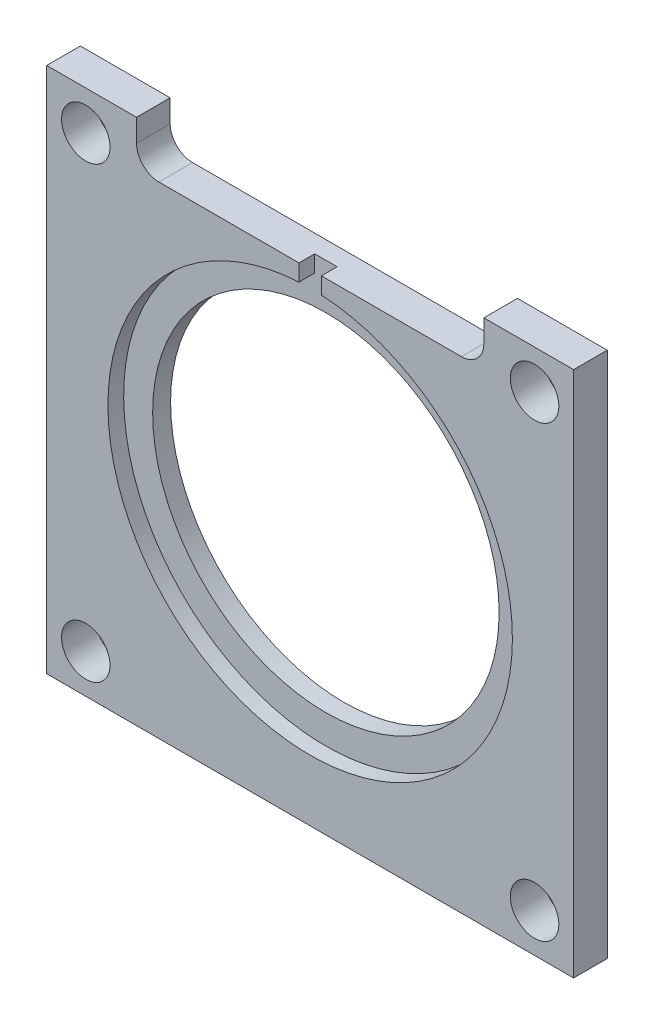
ISO-10303-21;
HEADER;
FILE_DESCRIPTION(('STEP AP214'),'2;1');
FILE_NAME('part.step','',(''),(''),'','','');
FILE_SCHEMA(('AUTOMOTIVE_DESIGN { 1 0 10303 214 1 1 1 1 }'));
ENDSEC;
DATA;
#1=APPLICATION_CONTEXT('core data for automotive mechanical design processes');
#2=APPLICATION_PROTOCOL_DEFINITION('international standard','automotive_design',2000,#1);
#3=PRODUCT_CONTEXT('',#1,'mechanical');
#4=PRODUCT('Part','Part','',(#3));
#5=PRODUCT_RELATED_PRODUCT_CATEGORY('part','',(#4));
#6=PRODUCT_DEFINITION_FORMATION('','',#4);
#7=PRODUCT_DEFINITION_CONTEXT('part definition',#1,'design');
#8=PRODUCT_DEFINITION('design','',#6,#7);
#9=PRODUCT_DEFINITION_SHAPE('','',#8);
#10=(LENGTH_UNIT() NAMED_UNIT(*) SI_UNIT(.MILLI.,.METRE.));
#11=(NAMED_UNIT(*) PLANE_ANGLE_UNIT() SI_UNIT($,.RADIAN.));
#12=(NAMED_UNIT(*) SI_UNIT($,.STERADIAN.) SOLID_ANGLE_UNIT());
#13=UNCERTAINTY_MEASURE_WITH_UNIT(LENGTH_MEASURE(1.E-05),#10,'distance_accuracy_value','');
#14=(GEOMETRIC_REPRESENTATION_CONTEXT(3) GLOBAL_UNCERTAINTY_ASSIGNED_CONTEXT((#13)) GLOBAL_UNIT_ASSIGNED_CONTEXT((#10,
#11,#12)) REPRESENTATION_CONTEXT('',''));
#15=CARTESIAN_POINT('',(0.,0.,0.));
#16=DIRECTION('',(0.,0.,1.));
#17=DIRECTION('',(1.,0.,0.));
#18=AXIS2_PLACEMENT_3D('',#15,#16,#17);
#19=CARTESIAN_POINT('',(0.,0.,-1.5875));
#20=DIRECTION('',(0.,0.,1.));
#21=DIRECTION('',(1.,0.,0.));
#22=AXIS2_PLACEMENT_3D('',#19,#20,#21);
#23=CYLINDRICAL_SURFACE('',#22,24.511);
#24=CARTESIAN_POINT('',(0.,0.,-1.5875));
#25=DIRECTION('',(0.,0.,1.));
#26=DIRECTION('',(1.,0.,0.));
#27=AXIS2_PLACEMENT_3D('',#24,#25,#26);
#28=CIRCLE('',#27,24.511);
#29=CARTESIAN_POINT('',(24.511,0.,-1.5875));
#30=VERTEX_POINT('',#29);
#31=EDGE_CURVE('E227',#30,#30,#28,.T.);
#32=ORIENTED_EDGE('',*,*,#31,.F.);
#33=EDGE_LOOP('',(#32));
#34=FACE_BOUND('',#33,.T.);
#35=CARTESIAN_POINT('',(0.,0.,0.9525));
#36=DIRECTION('',(0.,0.,1.));
#37=DIRECTION('',(1.,0.,0.));
#38=AXIS2_PLACEMENT_3D('',#35,#36,#37);
#39=CIRCLE('',#38,24.511);
#40=CARTESIAN_POINT('',(24.511,0.,0.9525));
#41=VERTEX_POINT('',#40);
#42=EDGE_CURVE('E158',#41,#41,#39,.F.);
#43=ORIENTED_EDGE('',*,*,#42,.F.);
#44=EDGE_LOOP('',(#43));
#45=FACE_BOUND('',#44,.T.);
#46=ADVANCED_FACE('F41',(#34,#45),#23,.F.);
#47=CARTESIAN_POINT('',(-37.2745,37.2745,-1.5875));
#48=DIRECTION('',(0.,1.,0.));
#49=DIRECTION('',(-1.,0.,0.));
#50=AXIS2_PLACEMENT_3D('',#47,#48,#49);
#51=PLANE('',#50);
#52=DIRECTION('',(0.,0.,1.));
#53=VECTOR('',#52,1.);
#54=CARTESIAN_POINT('',(-24.5745,37.2745,-1.5875));
#55=LINE('',#54,#53);
#56=CARTESIAN_POINT('',(-24.5745,37.2745,-1.5875));
#57=VERTEX_POINT('',#56);
#58=CARTESIAN_POINT('',(-24.5745,37.2745,3.175));
#59=VERTEX_POINT('',#58);
#60=EDGE_CURVE('E255',#57,#59,#55,.T.);
#61=ORIENTED_EDGE('',*,*,#60,.F.);
#62=DIRECTION('',(-1.,0.,0.));
#63=VECTOR('',#62,1.);
#64=CARTESIAN_POINT('',(-37.2745,37.2745,-1.5875));
#65=LINE('',#64,#63);
#66=CARTESIAN_POINT('',(-37.2745,37.2745,-1.5875));
#67=VERTEX_POINT('',#66);
#68=EDGE_CURVE('E239',#57,#67,#65,.T.);
#69=ORIENTED_EDGE('',*,*,#68,.T.);
#70=DIRECTION('',(0.,0.,1.));
#71=VECTOR('',#70,1.);
#72=CARTESIAN_POINT('',(-37.2745,37.2745,-1.5875));
#73=LINE('',#72,#71);
#74=CARTESIAN_POINT('',(-37.2745,37.2745,3.175));
#75=VERTEX_POINT('',#74);
#76=EDGE_CURVE('E244',#67,#75,#73,.T.);
#77=ORIENTED_EDGE('',*,*,#76,.T.);
#78=DIRECTION('',(-1.,0.,0.));
#79=VECTOR('',#78,1.);
#80=CARTESIAN_POINT('',(-37.2745,37.2745,3.175));
#81=LINE('',#80,#79);
#82=EDGE_CURVE('E223',#59,#75,#81,.T.);
#83=ORIENTED_EDGE('',*,*,#82,.F.);
#84=EDGE_LOOP('',(#61,#69,#77,#83));
#85=FACE_BOUND('',#84,.T.);
#86=ADVANCED_FACE('F313',(#85),#51,.T.);
#87=CARTESIAN_POINT('',(0.,0.,-1.5875));
#88=DIRECTION('',(0.,0.,1.));
#89=DIRECTION('',(1.,0.,0.));
#90=AXIS2_PLACEMENT_3D('',#87,#88,#89);
#91=PLANE('',#90);
#92=ORIENTED_EDGE('',*,*,#68,.F.);
#93=DIRECTION('',(0.,-1.,0.));
#94=VECTOR('',#93,1.);
#95=CARTESIAN_POINT('',(-24.5745,39.2150302847828,-1.5875));
#96=LINE('',#95,#94);
#97=CARTESIAN_POINT('',(-24.5745,34.0995,-1.5875));
#98=VERTEX_POINT('',#97);
#99=EDGE_CURVE('E180',#57,#98,#96,.T.);
#100=ORIENTED_EDGE('',*,*,#99,.T.);
#101=CARTESIAN_POINT('',(-21.3995,34.0995,-1.5875));
#102=DIRECTION('',(0.,0.,1.));
#103=DIRECTION('',(1.,0.,0.));
#104=AXIS2_PLACEMENT_3D('',#101,#102,#103);
#105=CIRCLE('',#104,3.175);
#106=CARTESIAN_POINT('',(-21.3995,30.9245,-1.5875));
#107=VERTEX_POINT('',#106);
#108=EDGE_CURVE('E274',#98,#107,#105,.T.);
#109=ORIENTED_EDGE('',*,*,#108,.T.);
#110=DIRECTION('',(1.,0.,0.));
#111=VECTOR('',#110,1.);
#112=CARTESIAN_POINT('',(-24.5745,30.9245,-1.5875));
#113=LINE('',#112,#111);
#114=CARTESIAN_POINT('',(21.3995,30.9245,-1.5875));
#115=VERTEX_POINT('',#114);
#116=EDGE_CURVE('E183',#107,#115,#113,.T.);
#117=ORIENTED_EDGE('',*,*,#116,.T.);
#118=CARTESIAN_POINT('',(21.3995,34.0995,-1.5875));
#119=DIRECTION('',(0.,0.,1.));
#120=DIRECTION('',(1.,0.,0.));
#121=AXIS2_PLACEMENT_3D('',#118,#119,#120);
#122=CIRCLE('',#121,3.175);
#123=CARTESIAN_POINT('',(24.5745,34.0995,-1.5875));
#124=VERTEX_POINT('',#123);
#125=EDGE_CURVE('E270',#115,#124,#122,.T.);
#126=ORIENTED_EDGE('',*,*,#125,.T.);
#127=DIRECTION('',(0.,1.,0.));
#128=VECTOR('',#127,1.);
#129=CARTESIAN_POINT('',(24.5745,39.2150302847828,-1.5875));
#130=LINE('',#129,#128);
#131=CARTESIAN_POINT('',(24.5745,37.2745,-1.5875));
#132=VERTEX_POINT('',#131);
#133=EDGE_CURVE('E186',#124,#132,#130,.T.);
#134=ORIENTED_EDGE('',*,*,#133,.T.);
#135=CARTESIAN_POINT('',(37.2745,37.2745,-1.5875));
#136=VERTEX_POINT('',#135);
#137=EDGE_CURVE('E240',#136,#132,#65,.T.);
#138=ORIENTED_EDGE('',*,*,#137,.F.);
#139=DIRECTION('',(0.,1.,0.));
#140=VECTOR('',#139,1.);
#141=CARTESIAN_POINT('',(37.2745,37.2745,-1.5875));
#142=LINE('',#141,#140);
#143=CARTESIAN_POINT('',(37.2745,-37.2745,-1.5875));
#144=VERTEX_POINT('',#143);
#145=EDGE_CURVE('E236',#144,#136,#142,.T.);
#146=ORIENTED_EDGE('',*,*,#145,.F.);
#147=DIRECTION('',(1.,0.,0.));
#148=VECTOR('',#147,1.);
#149=CARTESIAN_POINT('',(-37.2745,-37.2745,-1.5875));
#150=LINE('',#149,#148);
#151=CARTESIAN_POINT('',(-37.2745,-37.2745,-1.5875));
#152=VERTEX_POINT('',#151);
#153=EDGE_CURVE('E233',#152,#144,#150,.T.);
#154=ORIENTED_EDGE('',*,*,#153,.F.);
#155=DIRECTION('',(0.,-1.,0.));
#156=VECTOR('',#155,1.);
#157=CARTESIAN_POINT('',(-37.2745,37.2745,-1.5875));
#158=LINE('',#157,#156);
#159=EDGE_CURVE('E230',#67,#152,#158,.T.);
#160=ORIENTED_EDGE('',*,*,#159,.F.);
#161=EDGE_LOOP('',(#92,#100,#109,#117,#126,#134,#138,#146,#154,#160));
#162=FACE_BOUND('',#161,.T.);
#163=CARTESIAN_POINT('',(31.75,31.7499999999996,-1.5875));
#164=DIRECTION('',(0.,0.,-1.));
#165=DIRECTION('',(-1.,0.,0.));
#166=AXIS2_PLACEMENT_3D('',#163,#164,#165);
#167=CIRCLE('',#166,3.429);
#168=CARTESIAN_POINT('',(28.321,31.7499999999996,-1.5875));
#169=VERTEX_POINT('',#168);
#170=EDGE_CURVE('E203',#169,#169,#167,.T.);
#171=ORIENTED_EDGE('',*,*,#170,.F.);
#172=EDGE_LOOP('',(#171));
#173=FACE_BOUND('',#172,.T.);
#174=CARTESIAN_POINT('',(-31.75,31.7499999999996,-1.5875));
#175=DIRECTION('',(0.,0.,1.));
#176=DIRECTION('',(1.,0.,0.));
#177=AXIS2_PLACEMENT_3D('',#174,#175,#176);
#178=CIRCLE('',#177,3.429);
#179=CARTESIAN_POINT('',(-28.321,31.7499999999996,-1.5875));
#180=VERTEX_POINT('',#179);
#181=EDGE_CURVE('E209',#180,#180,#178,.T.);
#182=ORIENTED_EDGE('',*,*,#181,.T.);
#183=EDGE_LOOP('',(#182));
#184=FACE_BOUND('',#183,.T.);
#185=ORIENTED_EDGE('',*,*,#31,.T.);
#186=EDGE_LOOP('',(#185));
#187=FACE_BOUND('',#186,.T.);
#188=CARTESIAN_POINT('',(31.75,-31.7499999999996,-1.5875));
#189=DIRECTION('',(0.,0.,1.));
#190=DIRECTION('',(-1.,0.,0.));
#191=AXIS2_PLACEMENT_3D('',#188,#189,#190);
#192=CIRCLE('',#191,3.429);
#193=CARTESIAN_POINT('',(28.321,-31.7499999999996,-1.5875));
#194=VERTEX_POINT('',#193);
#195=EDGE_CURVE('E197',#194,#194,#192,.T.);
#196=ORIENTED_EDGE('',*,*,#195,.T.);
#197=EDGE_LOOP('',(#196));
#198=FACE_BOUND('',#197,.T.);
#199=CARTESIAN_POINT('',(-31.75,-31.7499999999996,-1.5875));
#200=DIRECTION('',(0.,0.,-1.));
#201=DIRECTION('',(1.,0.,0.));
#202=AXIS2_PLACEMENT_3D('',#199,#200,#201);
#203=CIRCLE('',#202,3.429);
#204=CARTESIAN_POINT('',(-28.321,-31.7499999999996,-1.5875));
#205=VERTEX_POINT('',#204);
#206=EDGE_CURVE('E191',#205,#205,#203,.T.);
#207=ORIENTED_EDGE('',*,*,#206,.F.);
#208=EDGE_LOOP('',(#207));
#209=FACE_BOUND('',#208,.T.);
#210=ADVANCED_FACE('F300',(#162,#173,#184,#187,#198,#209),#91,.F.);
#211=CARTESIAN_POINT('',(0.,0.,3.175));
#212=DIRECTION('',(0.,0.,1.));
#213=DIRECTION('',(1.,0.,0.));
#214=AXIS2_PLACEMENT_3D('',#211,#212,#213);
#215=PLANE('',#214);
#216=DIRECTION('',(0.,-1.,0.));
#217=VECTOR('',#216,1.);
#218=CARTESIAN_POINT('',(-1.5875,24.7546377176668,3.175));
#219=LINE('',#218,#217);
#220=CARTESIAN_POINT('',(-1.5875,30.9245,3.175));
#221=VERTEX_POINT('',#220);
#222=CARTESIAN_POINT('',(-1.5875,28.5690275536288,3.175));
#223=VERTEX_POINT('',#222);
#224=EDGE_CURVE('E149',#221,#223,#219,.T.);
#225=ORIENTED_EDGE('',*,*,#224,.F.);
#226=DIRECTION('',(1.,0.,0.));
#227=VECTOR('',#226,1.);
#228=CARTESIAN_POINT('',(-24.5745,30.9245,3.175));
#229=LINE('',#228,#227);
#230=CARTESIAN_POINT('',(-21.3995,30.9245,3.175));
#231=VERTEX_POINT('',#230);
#232=EDGE_CURVE('E175',#231,#221,#229,.T.);
#233=ORIENTED_EDGE('',*,*,#232,.F.);
#234=CARTESIAN_POINT('',(-21.3995,34.0995,3.175));
#235=DIRECTION('',(0.,0.,1.));
#236=DIRECTION('',(1.,0.,0.));
#237=AXIS2_PLACEMENT_3D('',#234,#235,#236);
#238=CIRCLE('',#237,3.175);
#239=CARTESIAN_POINT('',(-24.5745,34.0995,3.175));
#240=VERTEX_POINT('',#239);
#241=EDGE_CURVE('E272',#231,#240,#238,.F.);
#242=ORIENTED_EDGE('',*,*,#241,.T.);
#243=DIRECTION('',(0.,-1.,0.));
#244=VECTOR('',#243,1.);
#245=CARTESIAN_POINT('',(-24.5745,39.2150302847828,3.175));
#246=LINE('',#245,#244);
#247=EDGE_CURVE('E161',#59,#240,#246,.T.);
#248=ORIENTED_EDGE('',*,*,#247,.F.);
#249=ORIENTED_EDGE('',*,*,#82,.T.);
#250=DIRECTION('',(0.,-1.,0.));
#251=VECTOR('',#250,1.);
#252=CARTESIAN_POINT('',(-37.2745,37.2745,3.175));
#253=LINE('',#252,#251);
#254=CARTESIAN_POINT('',(-37.2745,-37.2745,3.175));
#255=VERTEX_POINT('',#254);
#256=EDGE_CURVE('E214',#75,#255,#253,.T.);
#257=ORIENTED_EDGE('',*,*,#256,.T.);
#258=DIRECTION('',(1.,0.,0.));
#259=VECTOR('',#258,1.);
#260=CARTESIAN_POINT('',(-37.2745,-37.2745,3.175));
#261=LINE('',#260,#259);
#262=CARTESIAN_POINT('',(37.2745,-37.2745,3.175));
#263=VERTEX_POINT('',#262);
#264=EDGE_CURVE('E217',#255,#263,#261,.T.);
#265=ORIENTED_EDGE('',*,*,#264,.T.);
#266=DIRECTION('',(0.,1.,0.));
#267=VECTOR('',#266,1.);
#268=CARTESIAN_POINT('',(37.2745,37.2745,3.175));
#269=LINE('',#268,#267);
#270=CARTESIAN_POINT('',(37.2745,37.2745,3.175));
#271=VERTEX_POINT('',#270);
#272=EDGE_CURVE('E220',#263,#271,#269,.T.);
#273=ORIENTED_EDGE('',*,*,#272,.T.);
#274=CARTESIAN_POINT('',(24.5745,37.2745,3.175));
#275=VERTEX_POINT('',#274);
#276=EDGE_CURVE('E224',#271,#275,#81,.T.);
#277=ORIENTED_EDGE('',*,*,#276,.T.);
#278=DIRECTION('',(0.,1.,0.));
#279=VECTOR('',#278,1.);
#280=CARTESIAN_POINT('',(24.5745,39.2150302847828,3.175));
#281=LINE('',#280,#279);
#282=CARTESIAN_POINT('',(24.5745,34.0995,3.175));
#283=VERTEX_POINT('',#282);
#284=EDGE_CURVE('E178',#283,#275,#281,.T.);
#285=ORIENTED_EDGE('',*,*,#284,.F.);
#286=CARTESIAN_POINT('',(21.3995,34.0995,3.175));
#287=DIRECTION('',(0.,0.,1.));
#288=DIRECTION('',(1.,0.,0.));
#289=AXIS2_PLACEMENT_3D('',#286,#287,#288);
#290=CIRCLE('',#289,3.175);
#291=CARTESIAN_POINT('',(21.3995,30.9245,3.175));
#292=VERTEX_POINT('',#291);
#293=EDGE_CURVE('E267',#283,#292,#290,.F.);
#294=ORIENTED_EDGE('',*,*,#293,.T.);
#295=CARTESIAN_POINT('',(1.5875,30.9245,3.175));
#296=VERTEX_POINT('',#295);
#297=EDGE_CURVE('E174',#296,#292,#229,.T.);
#298=ORIENTED_EDGE('',*,*,#297,.F.);
#299=DIRECTION('',(0.,1.,0.));
#300=VECTOR('',#299,1.);
#301=CARTESIAN_POINT('',(1.5875,24.7546377176668,3.175));
#302=LINE('',#301,#300);
#303=CARTESIAN_POINT('',(1.5875,28.5690275536288,3.175));
#304=VERTEX_POINT('',#303);
#305=EDGE_CURVE('E169',#304,#296,#302,.T.);
#306=ORIENTED_EDGE('',*,*,#305,.F.);
#307=CARTESIAN_POINT('',(0.,0.,3.175));
#308=DIRECTION('',(0.,0.,1.));
#309=DIRECTION('',(1.,0.,0.));
#310=AXIS2_PLACEMENT_3D('',#307,#308,#309);
#311=CIRCLE('',#310,28.6131);
#312=EDGE_CURVE('E212',#223,#304,#311,.T.);
#313=ORIENTED_EDGE('',*,*,#312,.F.);
#314=EDGE_LOOP('',(#225,#233,#242,#248,#249,#257,#265,#273,#277,#285,#294,#298,#306,#313));
#315=FACE_BOUND('',#314,.T.);
#316=CARTESIAN_POINT('',(31.75,31.7499999999996,3.175));
#317=DIRECTION('',(0.,0.,-1.));
#318=DIRECTION('',(-1.,0.,0.));
#319=AXIS2_PLACEMENT_3D('',#316,#317,#318);
#320=CIRCLE('',#319,3.429);
#321=CARTESIAN_POINT('',(28.321,31.7499999999996,3.175));
#322=VERTEX_POINT('',#321);
#323=EDGE_CURVE('E200',#322,#322,#320,.T.);
#324=ORIENTED_EDGE('',*,*,#323,.T.);
#325=EDGE_LOOP('',(#324));
#326=FACE_BOUND('',#325,.T.);
#327=CARTESIAN_POINT('',(-31.75,31.7499999999996,3.175));
#328=DIRECTION('',(0.,0.,1.));
#329=DIRECTION('',(1.,0.,0.));
#330=AXIS2_PLACEMENT_3D('',#327,#328,#329);
#331=CIRCLE('',#330,3.429);
#332=CARTESIAN_POINT('',(-28.321,31.7499999999996,3.175));
#333=VERTEX_POINT('',#332);
#334=EDGE_CURVE('E206',#333,#333,#331,.T.);
#335=ORIENTED_EDGE('',*,*,#334,.F.);
#336=EDGE_LOOP('',(#335));
#337=FACE_BOUND('',#336,.T.);
#338=CARTESIAN_POINT('',(31.75,-31.7499999999996,3.175));
#339=DIRECTION('',(0.,0.,1.));
#340=DIRECTION('',(-1.,0.,0.));
#341=AXIS2_PLACEMENT_3D('',#338,#339,#340);
#342=CIRCLE('',#341,3.429);
#343=CARTESIAN_POINT('',(28.321,-31.7499999999996,3.175));
#344=VERTEX_POINT('',#343);
#345=EDGE_CURVE('E194',#344,#344,#342,.T.);
#346=ORIENTED_EDGE('',*,*,#345,.F.);
#347=EDGE_LOOP('',(#346));
#348=FACE_BOUND('',#347,.T.);
#349=CARTESIAN_POINT('',(-31.75,-31.7499999999996,3.175));
#350=DIRECTION('',(0.,0.,-1.));
#351=DIRECTION('',(1.,0.,0.));
#352=AXIS2_PLACEMENT_3D('',#349,#350,#351);
#353=CIRCLE('',#352,3.429);
#354=CARTESIAN_POINT('',(-28.321,-31.7499999999996,3.175));
#355=VERTEX_POINT('',#354);
#356=EDGE_CURVE('E188',#355,#355,#353,.T.);
#357=ORIENTED_EDGE('',*,*,#356,.T.);
#358=EDGE_LOOP('',(#357));
#359=FACE_BOUND('',#358,.T.);
#360=ADVANCED_FACE('F288',(#315,#326,#337,#348,#359),#215,.T.);
#361=CARTESIAN_POINT('',(-37.2745,37.2745,-1.5875));
#362=DIRECTION('',(-1.,0.,0.));
#363=DIRECTION('',(0.,-1.,0.));
#364=AXIS2_PLACEMENT_3D('',#361,#362,#363);
#365=PLANE('',#364);
#366=DIRECTION('',(0.,0.,1.));
#367=VECTOR('',#366,1.);
#368=CARTESIAN_POINT('',(-37.2745,-37.2745,-1.5875));
#369=LINE('',#368,#367);
#370=EDGE_CURVE('E243',#152,#255,#369,.T.);
#371=ORIENTED_EDGE('',*,*,#370,.T.);
#372=ORIENTED_EDGE('',*,*,#256,.F.);
#373=ORIENTED_EDGE('',*,*,#76,.F.);
#374=ORIENTED_EDGE('',*,*,#159,.T.);
#375=EDGE_LOOP('',(#371,#372,#373,#374));
#376=FACE_BOUND('',#375,.T.);
#377=ADVANCED_FACE('F319',(#376),#365,.T.);
#378=DIRECTION('',(0.,0.,-1.));
#379=VECTOR('',#378,1.);
#380=CARTESIAN_POINT('',(24.5745,37.2745,-1.5875));
#381=LINE('',#380,#379);
#382=EDGE_CURVE('E247',#275,#132,#381,.T.);
#383=ORIENTED_EDGE('',*,*,#382,.F.);
#384=ORIENTED_EDGE('',*,*,#276,.F.);
#385=DIRECTION('',(0.,0.,1.));
#386=VECTOR('',#385,1.);
#387=CARTESIAN_POINT('',(37.2745,37.2745,-1.5875));
#388=LINE('',#387,#386);
#389=EDGE_CURVE('E248',#136,#271,#388,.T.);
#390=ORIENTED_EDGE('',*,*,#389,.F.);
#391=ORIENTED_EDGE('',*,*,#137,.T.);
#392=EDGE_LOOP('',(#383,#384,#390,#391));
#393=FACE_BOUND('',#392,.T.);
#394=ADVANCED_FACE('F330',(#393),#51,.T.);
#395=CARTESIAN_POINT('',(37.2745,37.2745,-1.5875));
#396=DIRECTION('',(1.,0.,0.));
#397=DIRECTION('',(0.,1.,0.));
#398=AXIS2_PLACEMENT_3D('',#395,#396,#397);
#399=PLANE('',#398);
#400=ORIENTED_EDGE('',*,*,#389,.T.);
#401=ORIENTED_EDGE('',*,*,#272,.F.);
#402=DIRECTION('',(0.,0.,1.));
#403=VECTOR('',#402,1.);
#404=CARTESIAN_POINT('',(37.2745,-37.2745,-1.5875));
#405=LINE('',#404,#403);
#406=EDGE_CURVE('E250',#144,#263,#405,.T.);
#407=ORIENTED_EDGE('',*,*,#406,.F.);
#408=ORIENTED_EDGE('',*,*,#145,.T.);
#409=EDGE_LOOP('',(#400,#401,#407,#408));
#410=FACE_BOUND('',#409,.T.);
#411=ADVANCED_FACE('F326',(#410),#399,.T.);
#412=CARTESIAN_POINT('',(-37.2745,-37.2745,-1.5875));
#413=DIRECTION('',(0.,-1.,0.));
#414=DIRECTION('',(0.,0.,-1.));
#415=AXIS2_PLACEMENT_3D('',#412,#413,#414);
#416=PLANE('',#415);
#417=ORIENTED_EDGE('',*,*,#406,.T.);
#418=ORIENTED_EDGE('',*,*,#264,.F.);
#419=ORIENTED_EDGE('',*,*,#370,.F.);
#420=ORIENTED_EDGE('',*,*,#153,.T.);
#421=EDGE_LOOP('',(#417,#418,#419,#420));
#422=FACE_BOUND('',#421,.T.);
#423=ADVANCED_FACE('F333',(#422),#416,.T.);
#424=CARTESIAN_POINT('',(0.,0.,3.175));
#425=DIRECTION('',(0.,0.,-1.));
#426=DIRECTION('',(-1.,0.,0.));
#427=AXIS2_PLACEMENT_3D('',#424,#425,#426);
#428=CYLINDRICAL_SURFACE('',#427,28.6131);
#429=DIRECTION('',(0.,0.,-1.));
#430=VECTOR('',#429,1.);
#431=CARTESIAN_POINT('',(-1.5875,28.5690275536288,3.175));
#432=LINE('',#431,#430);
#433=CARTESIAN_POINT('',(-1.5875,28.5690275536288,0.9525));
#434=VERTEX_POINT('',#433);
#435=EDGE_CURVE('E144',#223,#434,#432,.T.);
#436=ORIENTED_EDGE('',*,*,#435,.F.);
#437=ORIENTED_EDGE('',*,*,#312,.T.);
#438=DIRECTION('',(0.,0.,-1.));
#439=VECTOR('',#438,1.);
#440=CARTESIAN_POINT('',(1.5875,28.5690275536288,3.175));
#441=LINE('',#440,#439);
#442=CARTESIAN_POINT('',(1.5875,28.5690275536288,0.9525));
#443=VERTEX_POINT('',#442);
#444=EDGE_CURVE('E57',#443,#304,#441,.F.);
#445=ORIENTED_EDGE('',*,*,#444,.F.);
#446=CARTESIAN_POINT('',(0.,0.,0.9525));
#447=DIRECTION('',(0.,0.,1.));
#448=DIRECTION('',(1.,0.,0.));
#449=AXIS2_PLACEMENT_3D('',#446,#447,#448);
#450=CIRCLE('',#449,28.6131);
#451=EDGE_CURVE('E151',#434,#443,#450,.T.);
#452=ORIENTED_EDGE('',*,*,#451,.F.);
#453=EDGE_LOOP('',(#436,#437,#445,#452));
#454=FACE_BOUND('',#453,.T.);
#455=ADVANCED_FACE('F153',(#454),#428,.F.);
#456=CARTESIAN_POINT('',(-31.75,31.7499999999996,-1.5875));
#457=DIRECTION('',(0.,0.,1.));
#458=DIRECTION('',(1.,0.,0.));
#459=AXIS2_PLACEMENT_3D('',#456,#457,#458);
#460=CYLINDRICAL_SURFACE('',#459,3.429);
#461=ORIENTED_EDGE('',*,*,#181,.F.);
#462=EDGE_LOOP('',(#461));
#463=FACE_BOUND('',#462,.T.);
#464=ORIENTED_EDGE('',*,*,#334,.T.);
#465=EDGE_LOOP('',(#464));
#466=FACE_BOUND('',#465,.T.);
#467=ADVANCED_FACE('F340',(#463,#466),#460,.F.);
#468=CARTESIAN_POINT('',(31.75,31.7499999999996,-1.5875));
#469=DIRECTION('',(0.,0.,1.));
#470=DIRECTION('',(1.,0.,0.));
#471=AXIS2_PLACEMENT_3D('',#468,#469,#470);
#472=CYLINDRICAL_SURFACE('',#471,3.429);
#473=ORIENTED_EDGE('',*,*,#170,.T.);
#474=EDGE_LOOP('',(#473));
#475=FACE_BOUND('',#474,.T.);
#476=ORIENTED_EDGE('',*,*,#323,.F.);
#477=EDGE_LOOP('',(#476));
#478=FACE_BOUND('',#477,.T.);
#479=ADVANCED_FACE('F384',(#475,#478),#472,.F.);
#480=CARTESIAN_POINT('',(31.75,-31.7499999999996,-1.5875));
#481=DIRECTION('',(0.,0.,1.));
#482=DIRECTION('',(1.,0.,0.));
#483=AXIS2_PLACEMENT_3D('',#480,#481,#482);
#484=CYLINDRICAL_SURFACE('',#483,3.429);
#485=ORIENTED_EDGE('',*,*,#195,.F.);
#486=EDGE_LOOP('',(#485));
#487=FACE_BOUND('',#486,.T.);
#488=ORIENTED_EDGE('',*,*,#345,.T.);
#489=EDGE_LOOP('',(#488));
#490=FACE_BOUND('',#489,.T.);
#491=ADVANCED_FACE('F380',(#487,#490),#484,.F.);
#492=CARTESIAN_POINT('',(-31.75,-31.7499999999996,-1.5875));
#493=DIRECTION('',(0.,0.,1.));
#494=DIRECTION('',(1.,0.,0.));
#495=AXIS2_PLACEMENT_3D('',#492,#493,#494);
#496=CYLINDRICAL_SURFACE('',#495,3.429);
#497=ORIENTED_EDGE('',*,*,#206,.T.);
#498=EDGE_LOOP('',(#497));
#499=FACE_BOUND('',#498,.T.);
#500=ORIENTED_EDGE('',*,*,#356,.F.);
#501=EDGE_LOOP('',(#500));
#502=FACE_BOUND('',#501,.T.);
#503=ADVANCED_FACE('F377',(#499,#502),#496,.F.);
#504=CARTESIAN_POINT('',(-24.5745,39.2150302847828,-1.5875));
#505=DIRECTION('',(-1.,0.,0.));
#506=DIRECTION('',(0.,0.,1.));
#507=AXIS2_PLACEMENT_3D('',#504,#505,#506);
#508=PLANE('',#507);
#509=ORIENTED_EDGE('',*,*,#247,.T.);
#510=DIRECTION('',(0.,0.,1.));
#511=VECTOR('',#510,1.);
#512=CARTESIAN_POINT('',(-24.5745,34.0995,-1.5875));
#513=LINE('',#512,#511);
#514=EDGE_CURVE('E265',#240,#98,#513,.F.);
#515=ORIENTED_EDGE('',*,*,#514,.T.);
#516=ORIENTED_EDGE('',*,*,#99,.F.);
#517=ORIENTED_EDGE('',*,*,#60,.T.);
#518=EDGE_LOOP('',(#509,#515,#516,#517));
#519=FACE_BOUND('',#518,.T.);
#520=ADVANCED_FACE('F310',(#519),#508,.F.);
#521=CARTESIAN_POINT('',(24.5745,39.2150302847828,-1.5875));
#522=DIRECTION('',(1.,0.,0.));
#523=DIRECTION('',(0.,0.,-1.));
#524=AXIS2_PLACEMENT_3D('',#521,#522,#523);
#525=PLANE('',#524);
#526=ORIENTED_EDGE('',*,*,#133,.F.);
#527=DIRECTION('',(0.,0.,1.));
#528=VECTOR('',#527,1.);
#529=CARTESIAN_POINT('',(24.5745,34.0995,3.175));
#530=LINE('',#529,#528);
#531=EDGE_CURVE('E257',#124,#283,#530,.T.);
#532=ORIENTED_EDGE('',*,*,#531,.T.);
#533=ORIENTED_EDGE('',*,*,#284,.T.);
#534=ORIENTED_EDGE('',*,*,#382,.T.);
#535=EDGE_LOOP('',(#526,#532,#533,#534));
#536=FACE_BOUND('',#535,.T.);
#537=ADVANCED_FACE('F332',(#536),#525,.F.);
#538=CARTESIAN_POINT('',(-24.5745,30.9245,-1.5875));
#539=DIRECTION('',(0.,-1.,0.));
#540=DIRECTION('',(0.,0.,-1.));
#541=AXIS2_PLACEMENT_3D('',#538,#539,#540);
#542=PLANE('',#541);
#543=DIRECTION('',(0.,0.,1.));
#544=VECTOR('',#543,1.);
#545=CARTESIAN_POINT('',(1.5875,30.9245,-1.5875));
#546=LINE('',#545,#544);
#547=CARTESIAN_POINT('',(1.5875,30.9245,0.9525));
#548=VERTEX_POINT('',#547);
#549=EDGE_CURVE('E50',#548,#296,#546,.T.);
#550=ORIENTED_EDGE('',*,*,#549,.T.);
#551=ORIENTED_EDGE('',*,*,#297,.T.);
#552=DIRECTION('',(0.,0.,1.));
#553=VECTOR('',#552,1.);
#554=CARTESIAN_POINT('',(21.3995,30.9245,-1.5875));
#555=LINE('',#554,#553);
#556=EDGE_CURVE('E263',#292,#115,#555,.F.);
#557=ORIENTED_EDGE('',*,*,#556,.T.);
#558=ORIENTED_EDGE('',*,*,#116,.F.);
#559=DIRECTION('',(0.,0.,1.));
#560=VECTOR('',#559,1.);
#561=CARTESIAN_POINT('',(-21.3995,30.9245,3.175));
#562=LINE('',#561,#560);
#563=EDGE_CURVE('E260',#107,#231,#562,.T.);
#564=ORIENTED_EDGE('',*,*,#563,.T.);
#565=ORIENTED_EDGE('',*,*,#232,.T.);
#566=DIRECTION('',(0.,0.,-1.));
#567=VECTOR('',#566,1.);
#568=CARTESIAN_POINT('',(-1.5875,30.9245,-1.5875));
#569=LINE('',#568,#567);
#570=CARTESIAN_POINT('',(-1.5875,30.9245,0.9525));
#571=VERTEX_POINT('',#570);
#572=EDGE_CURVE('E12',#221,#571,#569,.T.);
#573=ORIENTED_EDGE('',*,*,#572,.T.);
#574=DIRECTION('',(-1.,0.,0.));
#575=VECTOR('',#574,1.);
#576=CARTESIAN_POINT('',(-24.5745,30.9245,0.9525));
#577=LINE('',#576,#575);
#578=EDGE_CURVE('E157',#548,#571,#577,.T.);
#579=ORIENTED_EDGE('',*,*,#578,.F.);
#580=EDGE_LOOP('',(#550,#551,#557,#558,#564,#565,#573,#579));
#581=FACE_BOUND('',#580,.T.);
#582=ADVANCED_FACE('F281',(#581),#542,.F.);
#583=CARTESIAN_POINT('',(21.3995,34.0995,-1.5875));
#584=DIRECTION('',(0.,0.,-1.));
#585=DIRECTION('',(-1.,0.,0.));
#586=AXIS2_PLACEMENT_3D('',#583,#584,#585);
#587=CYLINDRICAL_SURFACE('',#586,3.175);
#588=ORIENTED_EDGE('',*,*,#125,.F.);
#589=ORIENTED_EDGE('',*,*,#556,.F.);
#590=ORIENTED_EDGE('',*,*,#293,.F.);
#591=ORIENTED_EDGE('',*,*,#531,.F.);
#592=EDGE_LOOP('',(#588,#589,#590,#591));
#593=FACE_BOUND('',#592,.T.);
#594=ADVANCED_FACE('F295',(#593),#587,.F.);
#595=CARTESIAN_POINT('',(-21.3995,34.0995,-1.5875));
#596=DIRECTION('',(0.,0.,-1.));
#597=DIRECTION('',(-1.,0.,0.));
#598=AXIS2_PLACEMENT_3D('',#595,#596,#597);
#599=CYLINDRICAL_SURFACE('',#598,3.175);
#600=ORIENTED_EDGE('',*,*,#108,.F.);
#601=ORIENTED_EDGE('',*,*,#514,.F.);
#602=ORIENTED_EDGE('',*,*,#241,.F.);
#603=ORIENTED_EDGE('',*,*,#563,.F.);
#604=EDGE_LOOP('',(#600,#601,#602,#603));
#605=FACE_BOUND('',#604,.T.);
#606=ADVANCED_FACE('F43',(#605),#599,.F.);
#607=CARTESIAN_POINT('',(-1.5875,24.7546377176668,0.9525));
#608=DIRECTION('',(-1.,0.,0.));
#609=DIRECTION('',(0.,0.,1.));
#610=AXIS2_PLACEMENT_3D('',#607,#608,#609);
#611=PLANE('',#610);
#612=ORIENTED_EDGE('',*,*,#435,.T.);
#613=DIRECTION('',(0.,-1.,0.));
#614=VECTOR('',#613,1.);
#615=CARTESIAN_POINT('',(-1.5875,24.7546377176668,0.9525));
#616=LINE('',#615,#614);
#617=EDGE_CURVE('E147',#571,#434,#616,.T.);
#618=ORIENTED_EDGE('',*,*,#617,.F.);
#619=ORIENTED_EDGE('',*,*,#572,.F.);
#620=ORIENTED_EDGE('',*,*,#224,.T.);
#621=EDGE_LOOP('',(#612,#618,#619,#620));
#622=FACE_BOUND('',#621,.T.);
#623=ADVANCED_FACE('F145',(#622),#611,.F.);
#624=CARTESIAN_POINT('',(1.5875,24.7546377176668,0.9525));
#625=DIRECTION('',(1.,0.,0.));
#626=DIRECTION('',(0.,0.,-1.));
#627=AXIS2_PLACEMENT_3D('',#624,#625,#626);
#628=PLANE('',#627);
#629=DIRECTION('',(0.,1.,0.));
#630=VECTOR('',#629,1.);
#631=CARTESIAN_POINT('',(1.5875,24.7546377176668,0.9525));
#632=LINE('',#631,#630);
#633=EDGE_CURVE('E64',#443,#548,#632,.T.);
#634=ORIENTED_EDGE('',*,*,#633,.F.);
#635=ORIENTED_EDGE('',*,*,#444,.T.);
#636=ORIENTED_EDGE('',*,*,#305,.T.);
#637=ORIENTED_EDGE('',*,*,#549,.F.);
#638=EDGE_LOOP('',(#634,#635,#636,#637));
#639=FACE_BOUND('',#638,.T.);
#640=ADVANCED_FACE('F285',(#639),#628,.F.);
#641=CARTESIAN_POINT('',(0.,24.7546377176668,0.9525));
#642=DIRECTION('',(0.,0.,1.));
#643=DIRECTION('',(1.,0.,0.));
#644=AXIS2_PLACEMENT_3D('',#641,#642,#643);
#645=PLANE('',#644);
#646=ORIENTED_EDGE('',*,*,#42,.T.);
#647=EDGE_LOOP('',(#646));
#648=FACE_BOUND('',#647,.T.);
#649=ORIENTED_EDGE('',*,*,#617,.T.);
#650=ORIENTED_EDGE('',*,*,#451,.T.);
#651=ORIENTED_EDGE('',*,*,#633,.T.);
#652=ORIENTED_EDGE('',*,*,#578,.T.);
#653=EDGE_LOOP('',(#649,#650,#651,#652));
#654=FACE_BOUND('',#653,.T.);
#655=ADVANCED_FACE('F155',(#648,#654),#645,.T.);
#656=CLOSED_SHELL('',(#46,#86,#210,#360,#377,#394,#411,#423,#455,#467,#479,#491,#503,#520,#537,
#582,#594,#606,#623,#640,#655));
#657=MANIFOLD_SOLID_BREP('B2',#656);
#658=ADVANCED_BREP_SHAPE_REPRESENTATION('',(#18,#657),#14);
#659=SHAPE_DEFINITION_REPRESENTATION(#9,#658);
ENDSEC;
END-ISO-10303-21;
